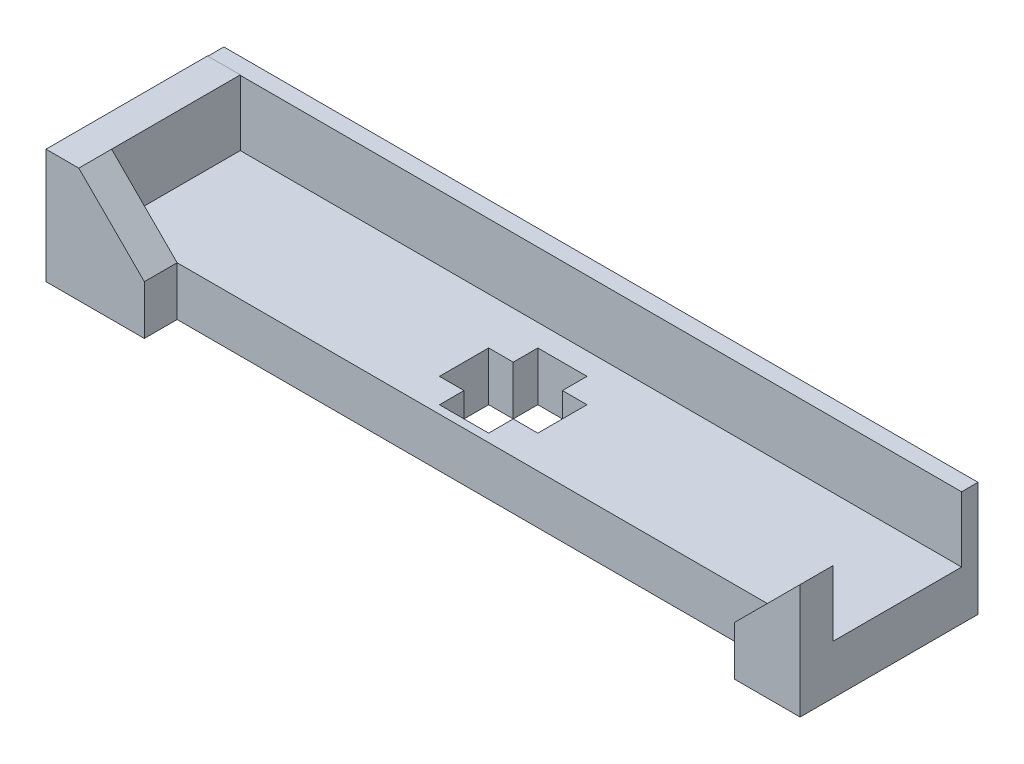
ISO-10303-21;
HEADER;
FILE_DESCRIPTION(('STEP AP214'),'2;1');
FILE_NAME('part.step','',(''),(''),'','','');
FILE_SCHEMA(('AUTOMOTIVE_DESIGN { 1 0 10303 214 1 1 1 1 }'));
ENDSEC;
DATA;
#1=APPLICATION_CONTEXT('core data for automotive mechanical design processes');
#2=APPLICATION_PROTOCOL_DEFINITION('international standard','automotive_design',2000,#1);
#3=PRODUCT_CONTEXT('',#1,'mechanical');
#4=PRODUCT('Part','Part','',(#3));
#5=PRODUCT_RELATED_PRODUCT_CATEGORY('part','',(#4));
#6=PRODUCT_DEFINITION_FORMATION('','',#4);
#7=PRODUCT_DEFINITION_CONTEXT('part definition',#1,'design');
#8=PRODUCT_DEFINITION('design','',#6,#7);
#9=PRODUCT_DEFINITION_SHAPE('','',#8);
#10=(LENGTH_UNIT() NAMED_UNIT(*) SI_UNIT(.MILLI.,.METRE.));
#11=(NAMED_UNIT(*) PLANE_ANGLE_UNIT() SI_UNIT($,.RADIAN.));
#12=(NAMED_UNIT(*) SI_UNIT($,.STERADIAN.) SOLID_ANGLE_UNIT());
#13=UNCERTAINTY_MEASURE_WITH_UNIT(LENGTH_MEASURE(1.E-05),#10,'distance_accuracy_value','');
#14=(GEOMETRIC_REPRESENTATION_CONTEXT(3) GLOBAL_UNCERTAINTY_ASSIGNED_CONTEXT((#13)) GLOBAL_UNIT_ASSIGNED_CONTEXT((#10,
#11,#12)) REPRESENTATION_CONTEXT('',''));
#15=CARTESIAN_POINT('',(0.,0.,0.));
#16=DIRECTION('',(0.,0.,1.));
#17=DIRECTION('',(1.,0.,0.));
#18=AXIS2_PLACEMENT_3D('',#15,#16,#17);
#19=CARTESIAN_POINT('',(-17.6129063467492,3.,12.4799729102168));
#20=DIRECTION('',(0.,0.,1.));
#21=DIRECTION('',(1.,0.,0.));
#22=AXIS2_PLACEMENT_3D('',#19,#20,#21);
#23=PLANE('',#22);
#24=DIRECTION('',(-1.,0.,0.));
#25=VECTOR('',#24,1.);
#26=CARTESIAN_POINT('',(-17.6129063467492,0.,12.4799729102168));
#27=LINE('',#26,#25);
#28=CARTESIAN_POINT('',(-11.6129063467492,0.,12.4799729102168));
#29=VERTEX_POINT('',#28);
#30=CARTESIAN_POINT('',(-13.1129063467492,0.,12.4799729102168));
#31=VERTEX_POINT('',#30);
#32=EDGE_CURVE('E262',#29,#31,#27,.T.);
#33=ORIENTED_EDGE('',*,*,#32,.T.);
#34=DIRECTION('',(0.,1.,0.));
#35=VECTOR('',#34,1.);
#36=CARTESIAN_POINT('',(-13.1129063467492,3.,12.4799729102168));
#37=LINE('',#36,#35);
#38=CARTESIAN_POINT('',(-13.1129063467492,3.,12.4799729102168));
#39=VERTEX_POINT('',#38);
#40=EDGE_CURVE('E254',#31,#39,#37,.T.);
#41=ORIENTED_EDGE('',*,*,#40,.T.);
#42=DIRECTION('',(-1.,0.,0.));
#43=VECTOR('',#42,1.);
#44=CARTESIAN_POINT('',(-17.6129063467492,3.,12.4799729102168));
#45=LINE('',#44,#43);
#46=CARTESIAN_POINT('',(-11.6129063467492,3.,12.4799729102168));
#47=VERTEX_POINT('',#46);
#48=EDGE_CURVE('E270',#47,#39,#45,.T.);
#49=ORIENTED_EDGE('',*,*,#48,.F.);
#50=DIRECTION('',(0.,-1.,0.));
#51=VECTOR('',#50,1.);
#52=CARTESIAN_POINT('',(-11.6129063467492,3.,12.4799729102168));
#53=LINE('',#52,#51);
#54=EDGE_CURVE('E288',#47,#29,#53,.T.);
#55=ORIENTED_EDGE('',*,*,#54,.T.);
#56=EDGE_LOOP('',(#33,#41,#49,#55));
#57=FACE_BOUND('',#56,.T.);
#58=ADVANCED_FACE('F35',(#57),#23,.F.);
#59=CARTESIAN_POINT('',(-17.6129063467492,3.,9.47997291021678));
#60=DIRECTION('',(0.,0.,-1.));
#61=DIRECTION('',(-1.,0.,0.));
#62=AXIS2_PLACEMENT_3D('',#59,#60,#61);
#63=PLANE('',#62);
#64=DIRECTION('',(1.,0.,0.));
#65=VECTOR('',#64,1.);
#66=CARTESIAN_POINT('',(-17.6129063467492,3.,9.47997291021678));
#67=LINE('',#66,#65);
#68=CARTESIAN_POINT('',(-13.1129063467492,3.,9.47997291021678));
#69=VERTEX_POINT('',#68);
#70=CARTESIAN_POINT('',(-11.6129063467492,3.,9.47997291021678));
#71=VERTEX_POINT('',#70);
#72=EDGE_CURVE('E261',#69,#71,#67,.T.);
#73=ORIENTED_EDGE('',*,*,#72,.F.);
#74=DIRECTION('',(0.,-1.,0.));
#75=VECTOR('',#74,1.);
#76=CARTESIAN_POINT('',(-13.1129063467492,3.,9.47997291021678));
#77=LINE('',#76,#75);
#78=CARTESIAN_POINT('',(-13.1129063467492,0.,9.47997291021678));
#79=VERTEX_POINT('',#78);
#80=EDGE_CURVE('E11',#69,#79,#77,.T.);
#81=ORIENTED_EDGE('',*,*,#80,.T.);
#82=DIRECTION('',(1.,0.,0.));
#83=VECTOR('',#82,1.);
#84=CARTESIAN_POINT('',(-17.6129063467492,0.,9.47997291021678));
#85=LINE('',#84,#83);
#86=CARTESIAN_POINT('',(-11.6129063467492,0.,9.47997291021678));
#87=VERTEX_POINT('',#86);
#88=EDGE_CURVE('E274',#79,#87,#85,.T.);
#89=ORIENTED_EDGE('',*,*,#88,.T.);
#90=DIRECTION('',(0.,-1.,0.));
#91=VECTOR('',#90,1.);
#92=CARTESIAN_POINT('',(-11.6129063467492,3.,9.47997291021678));
#93=LINE('',#92,#91);
#94=EDGE_CURVE('E290',#71,#87,#93,.T.);
#95=ORIENTED_EDGE('',*,*,#94,.F.);
#96=EDGE_LOOP('',(#73,#81,#89,#95));
#97=FACE_BOUND('',#96,.T.);
#98=ADVANCED_FACE('F488',(#97),#63,.F.);
#99=CARTESIAN_POINT('',(-35.6129063467492,3.,6.62997291021679));
#100=DIRECTION('',(0.,0.,1.));
#101=DIRECTION('',(1.,0.,0.));
#102=AXIS2_PLACEMENT_3D('',#99,#100,#101);
#103=PLANE('',#102);
#104=DIRECTION('',(1.,0.,0.));
#105=VECTOR('',#104,1.);
#106=CARTESIAN_POINT('',(8.38709365325076,6.97653999567155,6.62997291021679));
#107=LINE('',#106,#105);
#108=CARTESIAN_POINT('',(-37.6129063467492,6.97653999567155,6.62997291021678));
#109=VERTEX_POINT('',#108);
#110=CARTESIAN_POINT('',(-35.6129063467492,6.97653999567155,6.62997291021679));
#111=VERTEX_POINT('',#110);
#112=EDGE_CURVE('E299',#109,#111,#107,.T.);
#113=ORIENTED_EDGE('',*,*,#112,.F.);
#114=DIRECTION('',(0.,-1.,0.));
#115=VECTOR('',#114,1.);
#116=CARTESIAN_POINT('',(-37.6129063467492,0.,6.62997291021679));
#117=LINE('',#116,#115);
#118=CARTESIAN_POINT('',(-37.6129063467492,7.,6.62997291021678));
#119=VERTEX_POINT('',#118);
#120=EDGE_CURVE('E372',#119,#109,#117,.T.);
#121=ORIENTED_EDGE('',*,*,#120,.F.);
#122=DIRECTION('',(1.,0.,0.));
#123=VECTOR('',#122,1.);
#124=CARTESIAN_POINT('',(-37.6129063467492,7.,6.62997291021678));
#125=LINE('',#124,#123);
#126=CARTESIAN_POINT('',(-35.6129063467492,7.,6.62997291021678));
#127=VERTEX_POINT('',#126);
#128=EDGE_CURVE('E395',#119,#127,#125,.T.);
#129=ORIENTED_EDGE('',*,*,#128,.T.);
#130=DIRECTION('',(0.,-1.,0.));
#131=VECTOR('',#130,1.);
#132=CARTESIAN_POINT('',(-35.6129063467492,0.,6.62997291021679));
#133=LINE('',#132,#131);
#134=EDGE_CURVE('E383',#127,#111,#133,.T.);
#135=ORIENTED_EDGE('',*,*,#134,.T.);
#136=EDGE_LOOP('',(#113,#121,#129,#135));
#137=FACE_BOUND('',#136,.T.);
#138=ADVANCED_FACE('F514',(#137),#103,.F.);
#139=CARTESIAN_POINT('',(-35.6129063467492,3.,14.4799729102168));
#140=DIRECTION('',(0.,0.,-1.));
#141=DIRECTION('',(-1.,0.,0.));
#142=AXIS2_PLACEMENT_3D('',#139,#140,#141);
#143=PLANE('',#142);
#144=DIRECTION('',(0.,-1.,0.));
#145=VECTOR('',#144,1.);
#146=CARTESIAN_POINT('',(4.38709365325076,3.,14.4799729102168));
#147=LINE('',#146,#145);
#148=CARTESIAN_POINT('',(4.38709365325075,3.,14.4799729102168));
#149=VERTEX_POINT('',#148);
#150=CARTESIAN_POINT('',(4.38709365325075,0.,14.4799729102168));
#151=VERTEX_POINT('',#150);
#152=EDGE_CURVE('E319',#149,#151,#147,.T.);
#153=ORIENTED_EDGE('',*,*,#152,.F.);
#154=DIRECTION('',(1.,0.,0.));
#155=VECTOR('',#154,1.);
#156=CARTESIAN_POINT('',(-35.6129063467492,3.,14.4799729102168));
#157=LINE('',#156,#155);
#158=CARTESIAN_POINT('',(-31.6129063467492,3.,14.4799729102168));
#159=VERTEX_POINT('',#158);
#160=EDGE_CURVE('E407',#159,#149,#157,.T.);
#161=ORIENTED_EDGE('',*,*,#160,.F.);
#162=DIRECTION('',(0.,1.,0.));
#163=VECTOR('',#162,1.);
#164=CARTESIAN_POINT('',(-31.6129063467492,3.,14.4799729102168));
#165=LINE('',#164,#163);
#166=CARTESIAN_POINT('',(-31.6129063467492,0.,14.4799729102168));
#167=VERTEX_POINT('',#166);
#168=EDGE_CURVE('E344',#167,#159,#165,.T.);
#169=ORIENTED_EDGE('',*,*,#168,.F.);
#170=DIRECTION('',(1.,0.,0.));
#171=VECTOR('',#170,1.);
#172=CARTESIAN_POINT('',(-35.6129063467492,0.,14.4799729102168));
#173=LINE('',#172,#171);
#174=EDGE_CURVE('E417',#167,#151,#173,.T.);
#175=ORIENTED_EDGE('',*,*,#174,.T.);
#176=EDGE_LOOP('',(#153,#161,#169,#175));
#177=FACE_BOUND('',#176,.T.);
#178=ADVANCED_FACE('F37',(#177),#143,.F.);
#179=CARTESIAN_POINT('',(8.38709365325076,3.,6.62997291021679));
#180=DIRECTION('',(-1.,0.,0.));
#181=DIRECTION('',(0.,0.,1.));
#182=AXIS2_PLACEMENT_3D('',#179,#180,#181);
#183=PLANE('',#182);
#184=DIRECTION('',(0.,0.,-1.));
#185=VECTOR('',#184,1.);
#186=CARTESIAN_POINT('',(8.38709365325076,0.,6.62997291021679));
#187=LINE('',#186,#185);
#188=CARTESIAN_POINT('',(8.38709365325076,0.,16.4799729102168));
#189=VERTEX_POINT('',#188);
#190=CARTESIAN_POINT('',(8.38709365325076,0.,5.62997291021679));
#191=VERTEX_POINT('',#190);
#192=EDGE_CURVE('E408',#189,#191,#187,.T.);
#193=ORIENTED_EDGE('',*,*,#192,.T.);
#194=DIRECTION('',(0.,-1.,0.));
#195=VECTOR('',#194,1.);
#196=CARTESIAN_POINT('',(8.38709365325076,0.,5.62997291021679));
#197=LINE('',#196,#195);
#198=CARTESIAN_POINT('',(8.38709365325076,6.97653999567155,5.62997291021679));
#199=VERTEX_POINT('',#198);
#200=EDGE_CURVE('E295',#199,#191,#197,.T.);
#201=ORIENTED_EDGE('',*,*,#200,.F.);
#202=DIRECTION('',(0.,0.,1.));
#203=VECTOR('',#202,1.);
#204=CARTESIAN_POINT('',(8.38709365325076,6.97653999567155,5.62997291021679));
#205=LINE('',#204,#203);
#206=CARTESIAN_POINT('',(8.38709365325076,6.97653999567155,6.62997291021679));
#207=VERTEX_POINT('',#206);
#208=EDGE_CURVE('E306',#199,#207,#205,.T.);
#209=ORIENTED_EDGE('',*,*,#208,.T.);
#210=DIRECTION('',(0.,-1.,0.));
#211=VECTOR('',#210,1.);
#212=CARTESIAN_POINT('',(8.38709365325076,0.,6.62997291021679));
#213=LINE('',#212,#211);
#214=CARTESIAN_POINT('',(8.38709365325076,3.,6.62997291021679));
#215=VERTEX_POINT('',#214);
#216=EDGE_CURVE('E287',#207,#215,#213,.T.);
#217=ORIENTED_EDGE('',*,*,#216,.T.);
#218=DIRECTION('',(0.,0.,-1.));
#219=VECTOR('',#218,1.);
#220=CARTESIAN_POINT('',(8.38709365325076,3.,6.62997291021679));
#221=LINE('',#220,#219);
#222=CARTESIAN_POINT('',(8.38709365325076,3.,14.4799729102168));
#223=VERTEX_POINT('',#222);
#224=EDGE_CURVE('E414',#223,#215,#221,.T.);
#225=ORIENTED_EDGE('',*,*,#224,.F.);
#226=DIRECTION('',(0.,1.,0.));
#227=VECTOR('',#226,1.);
#228=CARTESIAN_POINT('',(8.38709365325076,0.,14.4799729102168));
#229=LINE('',#228,#227);
#230=CARTESIAN_POINT('',(8.38709365325076,7.,14.4799729102168));
#231=VERTEX_POINT('',#230);
#232=EDGE_CURVE('E326',#223,#231,#229,.T.);
#233=ORIENTED_EDGE('',*,*,#232,.T.);
#234=DIRECTION('',(0.,0.,-1.));
#235=VECTOR('',#234,1.);
#236=CARTESIAN_POINT('',(8.38709365325076,7.,16.4799729102168));
#237=LINE('',#236,#235);
#238=CARTESIAN_POINT('',(8.38709365325076,7.,16.4799729102168));
#239=VERTEX_POINT('',#238);
#240=EDGE_CURVE('E339',#239,#231,#237,.T.);
#241=ORIENTED_EDGE('',*,*,#240,.F.);
#242=DIRECTION('',(0.,1.,0.));
#243=VECTOR('',#242,1.);
#244=CARTESIAN_POINT('',(8.38709365325076,0.,16.4799729102168));
#245=LINE('',#244,#243);
#246=EDGE_CURVE('E318',#189,#239,#245,.T.);
#247=ORIENTED_EDGE('',*,*,#246,.F.);
#248=EDGE_LOOP('',(#193,#201,#209,#217,#225,#233,#241,#247));
#249=FACE_BOUND('',#248,.T.);
#250=ADVANCED_FACE('F455',(#249),#183,.F.);
#251=CARTESIAN_POINT('',(0.,3.,0.));
#252=DIRECTION('',(0.,1.,0.));
#253=DIRECTION('',(0.,0.,1.));
#254=AXIS2_PLACEMENT_3D('',#251,#252,#253);
#255=PLANE('',#254);
#256=DIRECTION('',(0.,0.,1.));
#257=VECTOR('',#256,1.);
#258=CARTESIAN_POINT('',(-13.1129063467492,3.,13.9799729102168));
#259=LINE('',#258,#257);
#260=CARTESIAN_POINT('',(-13.1129063467492,3.,7.97997291021679));
#261=VERTEX_POINT('',#260);
#262=EDGE_CURVE('E218',#261,#69,#259,.T.);
#263=ORIENTED_EDGE('',*,*,#262,.T.);
#264=ORIENTED_EDGE('',*,*,#72,.T.);
#265=DIRECTION('',(0.,0.,1.));
#266=VECTOR('',#265,1.);
#267=CARTESIAN_POINT('',(-11.6129063467492,3.,12.4799729102168));
#268=LINE('',#267,#266);
#269=EDGE_CURVE('E266',#71,#47,#268,.T.);
#270=ORIENTED_EDGE('',*,*,#269,.T.);
#271=ORIENTED_EDGE('',*,*,#48,.T.);
#272=CARTESIAN_POINT('',(-13.1129063467492,3.,13.9799729102168));
#273=VERTEX_POINT('',#272);
#274=EDGE_CURVE('E232',#39,#273,#259,.T.);
#275=ORIENTED_EDGE('',*,*,#274,.T.);
#276=DIRECTION('',(-1.,0.,0.));
#277=VECTOR('',#276,1.);
#278=CARTESIAN_POINT('',(-16.1129063467492,3.,13.9799729102168));
#279=LINE('',#278,#277);
#280=CARTESIAN_POINT('',(-16.1129063467492,3.,13.9799729102168));
#281=VERTEX_POINT('',#280);
#282=EDGE_CURVE('E213',#273,#281,#279,.T.);
#283=ORIENTED_EDGE('',*,*,#282,.T.);
#284=DIRECTION('',(0.,0.,-1.));
#285=VECTOR('',#284,1.);
#286=CARTESIAN_POINT('',(-16.1129063467492,3.,13.9799729102168));
#287=LINE('',#286,#285);
#288=CARTESIAN_POINT('',(-16.1129063467492,3.,12.4799729102168));
#289=VERTEX_POINT('',#288);
#290=EDGE_CURVE('E221',#281,#289,#287,.T.);
#291=ORIENTED_EDGE('',*,*,#290,.T.);
#292=CARTESIAN_POINT('',(-17.6129063467492,3.,12.4799729102168));
#293=VERTEX_POINT('',#292);
#294=EDGE_CURVE('E269',#289,#293,#45,.T.);
#295=ORIENTED_EDGE('',*,*,#294,.T.);
#296=DIRECTION('',(0.,0.,-1.));
#297=VECTOR('',#296,1.);
#298=CARTESIAN_POINT('',(-17.6129063467492,3.,12.4799729102168));
#299=LINE('',#298,#297);
#300=CARTESIAN_POINT('',(-17.6129063467492,3.,9.47997291021678));
#301=VERTEX_POINT('',#300);
#302=EDGE_CURVE('E258',#293,#301,#299,.T.);
#303=ORIENTED_EDGE('',*,*,#302,.T.);
#304=CARTESIAN_POINT('',(-16.1129063467492,3.,9.47997291021678));
#305=VERTEX_POINT('',#304);
#306=EDGE_CURVE('E263',#301,#305,#67,.T.);
#307=ORIENTED_EDGE('',*,*,#306,.T.);
#308=CARTESIAN_POINT('',(-16.1129063467492,3.,7.97997291021678));
#309=VERTEX_POINT('',#308);
#310=EDGE_CURVE('E58',#305,#309,#287,.T.);
#311=ORIENTED_EDGE('',*,*,#310,.T.);
#312=DIRECTION('',(1.,0.,0.));
#313=VECTOR('',#312,1.);
#314=CARTESIAN_POINT('',(-16.1129063467492,3.,7.97997291021678));
#315=LINE('',#314,#313);
#316=EDGE_CURVE('E226',#309,#261,#315,.T.);
#317=ORIENTED_EDGE('',*,*,#316,.T.);
#318=EDGE_LOOP('',(#263,#264,#270,#271,#275,#283,#291,#295,#303,#307,#311,#317));
#319=FACE_BOUND('',#318,.T.);
#320=DIRECTION('',(0.,0.,1.));
#321=VECTOR('',#320,1.);
#322=CARTESIAN_POINT('',(-35.6129063467492,3.,6.62997291021679));
#323=LINE('',#322,#321);
#324=CARTESIAN_POINT('',(-35.6129063467492,3.,6.62997291021679));
#325=VERTEX_POINT('',#324);
#326=CARTESIAN_POINT('',(-35.6129063467492,3.,14.4799729102168));
#327=VERTEX_POINT('',#326);
#328=EDGE_CURVE('E403',#325,#327,#323,.T.);
#329=ORIENTED_EDGE('',*,*,#328,.T.);
#330=EDGE_CURVE('E421',#327,#159,#157,.T.);
#331=ORIENTED_EDGE('',*,*,#330,.T.);
#332=ORIENTED_EDGE('',*,*,#160,.T.);
#333=DIRECTION('',(1.,0.,0.));
#334=VECTOR('',#333,1.);
#335=CARTESIAN_POINT('',(0.,3.,14.4799729102168));
#336=LINE('',#335,#334);
#337=EDGE_CURVE('E342',#149,#223,#336,.T.);
#338=ORIENTED_EDGE('',*,*,#337,.T.);
#339=ORIENTED_EDGE('',*,*,#224,.T.);
#340=DIRECTION('',(-1.,0.,0.));
#341=VECTOR('',#340,1.);
#342=CARTESIAN_POINT('',(-35.6129063467492,3.,6.62997291021679));
#343=LINE('',#342,#341);
#344=EDGE_CURVE('E411',#215,#325,#343,.T.);
#345=ORIENTED_EDGE('',*,*,#344,.T.);
#346=EDGE_LOOP('',(#329,#331,#332,#338,#339,#345));
#347=FACE_BOUND('',#346,.T.);
#348=ADVANCED_FACE('F229',(#319,#347),#255,.T.);
#349=CARTESIAN_POINT('',(0.,0.,0.));
#350=DIRECTION('',(0.,1.,0.));
#351=DIRECTION('',(0.,0.,1.));
#352=AXIS2_PLACEMENT_3D('',#349,#350,#351);
#353=PLANE('',#352);
#354=ORIENTED_EDGE('',*,*,#88,.F.);
#355=DIRECTION('',(0.,0.,1.));
#356=VECTOR('',#355,1.);
#357=CARTESIAN_POINT('',(-13.1129063467492,0.,13.9799729102168));
#358=LINE('',#357,#356);
#359=CARTESIAN_POINT('',(-13.1129063467492,0.,7.97997291021679));
#360=VERTEX_POINT('',#359);
#361=EDGE_CURVE('E233',#360,#79,#358,.T.);
#362=ORIENTED_EDGE('',*,*,#361,.F.);
#363=DIRECTION('',(1.,0.,0.));
#364=VECTOR('',#363,1.);
#365=CARTESIAN_POINT('',(-16.1129063467492,0.,7.97997291021678));
#366=LINE('',#365,#364);
#367=CARTESIAN_POINT('',(-16.1129063467492,0.,7.97997291021678));
#368=VERTEX_POINT('',#367);
#369=EDGE_CURVE('E244',#368,#360,#366,.T.);
#370=ORIENTED_EDGE('',*,*,#369,.F.);
#371=DIRECTION('',(0.,0.,-1.));
#372=VECTOR('',#371,1.);
#373=CARTESIAN_POINT('',(-16.1129063467492,0.,13.9799729102168));
#374=LINE('',#373,#372);
#375=CARTESIAN_POINT('',(-16.1129063467492,0.,9.47997291021678));
#376=VERTEX_POINT('',#375);
#377=EDGE_CURVE('E242',#376,#368,#374,.T.);
#378=ORIENTED_EDGE('',*,*,#377,.F.);
#379=CARTESIAN_POINT('',(-17.6129063467492,0.,9.47997291021678));
#380=VERTEX_POINT('',#379);
#381=EDGE_CURVE('E275',#380,#376,#85,.T.);
#382=ORIENTED_EDGE('',*,*,#381,.F.);
#383=DIRECTION('',(0.,0.,-1.));
#384=VECTOR('',#383,1.);
#385=CARTESIAN_POINT('',(-17.6129063467492,0.,12.4799729102168));
#386=LINE('',#385,#384);
#387=CARTESIAN_POINT('',(-17.6129063467492,0.,12.4799729102168));
#388=VERTEX_POINT('',#387);
#389=EDGE_CURVE('E257',#388,#380,#386,.T.);
#390=ORIENTED_EDGE('',*,*,#389,.F.);
#391=CARTESIAN_POINT('',(-16.1129063467492,0.,12.4799729102168));
#392=VERTEX_POINT('',#391);
#393=EDGE_CURVE('E281',#392,#388,#27,.T.);
#394=ORIENTED_EDGE('',*,*,#393,.F.);
#395=CARTESIAN_POINT('',(-16.1129063467492,0.,13.9799729102168));
#396=VERTEX_POINT('',#395);
#397=EDGE_CURVE('E50',#396,#392,#374,.T.);
#398=ORIENTED_EDGE('',*,*,#397,.F.);
#399=DIRECTION('',(-1.,0.,0.));
#400=VECTOR('',#399,1.);
#401=CARTESIAN_POINT('',(-16.1129063467492,0.,13.9799729102168));
#402=LINE('',#401,#400);
#403=CARTESIAN_POINT('',(-13.1129063467492,0.,13.9799729102168));
#404=VERTEX_POINT('',#403);
#405=EDGE_CURVE('E216',#404,#396,#402,.T.);
#406=ORIENTED_EDGE('',*,*,#405,.F.);
#407=EDGE_CURVE('E235',#31,#404,#358,.T.);
#408=ORIENTED_EDGE('',*,*,#407,.F.);
#409=ORIENTED_EDGE('',*,*,#32,.F.);
#410=DIRECTION('',(0.,0.,1.));
#411=VECTOR('',#410,1.);
#412=CARTESIAN_POINT('',(-11.6129063467492,0.,12.4799729102168));
#413=LINE('',#412,#411);
#414=EDGE_CURVE('E278',#87,#29,#413,.T.);
#415=ORIENTED_EDGE('',*,*,#414,.F.);
#416=EDGE_LOOP('',(#354,#362,#370,#378,#382,#390,#394,#398,#406,#408,#409,#415));
#417=FACE_BOUND('',#416,.T.);
#418=ORIENTED_EDGE('',*,*,#174,.F.);
#419=DIRECTION('',(0.,0.,-1.));
#420=VECTOR('',#419,1.);
#421=CARTESIAN_POINT('',(-31.6129063467492,0.,16.4799729102168));
#422=LINE('',#421,#420);
#423=CARTESIAN_POINT('',(-31.6129063467492,0.,16.4799729102168));
#424=VERTEX_POINT('',#423);
#425=EDGE_CURVE('E366',#424,#167,#422,.T.);
#426=ORIENTED_EDGE('',*,*,#425,.F.);
#427=DIRECTION('',(1.,0.,0.));
#428=VECTOR('',#427,1.);
#429=CARTESIAN_POINT('',(-35.6129063467492,0.,16.4799729102168));
#430=LINE('',#429,#428);
#431=CARTESIAN_POINT('',(-37.6129063467492,0.,16.4799729102168));
#432=VERTEX_POINT('',#431);
#433=EDGE_CURVE('E352',#432,#424,#430,.T.);
#434=ORIENTED_EDGE('',*,*,#433,.F.);
#435=DIRECTION('',(0.,0.,1.));
#436=VECTOR('',#435,1.);
#437=CARTESIAN_POINT('',(-37.6129063467492,0.,6.62997291021679));
#438=LINE('',#437,#436);
#439=CARTESIAN_POINT('',(-37.6129063467492,0.,5.62997291021679));
#440=VERTEX_POINT('',#439);
#441=EDGE_CURVE('E369',#440,#432,#438,.T.);
#442=ORIENTED_EDGE('',*,*,#441,.F.);
#443=DIRECTION('',(-1.,0.,0.));
#444=VECTOR('',#443,1.);
#445=CARTESIAN_POINT('',(8.38709365325076,0.,5.62997291021679));
#446=LINE('',#445,#444);
#447=EDGE_CURVE('E298',#191,#440,#446,.T.);
#448=ORIENTED_EDGE('',*,*,#447,.F.);
#449=ORIENTED_EDGE('',*,*,#192,.F.);
#450=DIRECTION('',(1.,0.,0.));
#451=VECTOR('',#450,1.);
#452=CARTESIAN_POINT('',(4.38709365325075,0.,16.4799729102168));
#453=LINE('',#452,#451);
#454=CARTESIAN_POINT('',(4.38709365325075,0.,16.4799729102168));
#455=VERTEX_POINT('',#454);
#456=EDGE_CURVE('E315',#455,#189,#453,.T.);
#457=ORIENTED_EDGE('',*,*,#456,.F.);
#458=DIRECTION('',(0.,0.,-1.));
#459=VECTOR('',#458,1.);
#460=CARTESIAN_POINT('',(4.38709365325075,0.,16.4799729102168));
#461=LINE('',#460,#459);
#462=EDGE_CURVE('E325',#455,#151,#461,.T.);
#463=ORIENTED_EDGE('',*,*,#462,.T.);
#464=EDGE_LOOP('',(#418,#426,#434,#442,#448,#449,#457,#463));
#465=FACE_BOUND('',#464,.T.);
#466=ADVANCED_FACE('F434',(#417,#465),#353,.F.);
#467=CARTESIAN_POINT('',(-35.6129063467492,0.,0.));
#468=DIRECTION('',(1.,0.,0.));
#469=DIRECTION('',(0.,0.,-1.));
#470=AXIS2_PLACEMENT_3D('',#467,#468,#469);
#471=PLANE('',#470);
#472=ORIENTED_EDGE('',*,*,#328,.F.);
#473=EDGE_CURVE('E379',#111,#325,#133,.T.);
#474=ORIENTED_EDGE('',*,*,#473,.F.);
#475=ORIENTED_EDGE('',*,*,#134,.F.);
#476=DIRECTION('',(0.,0.,-1.));
#477=VECTOR('',#476,1.);
#478=CARTESIAN_POINT('',(-35.6129063467492,7.,6.62997291021678));
#479=LINE('',#478,#477);
#480=CARTESIAN_POINT('',(-35.6129063467492,7.,14.4799729102168));
#481=VERTEX_POINT('',#480);
#482=EDGE_CURVE('E376',#481,#127,#479,.T.);
#483=ORIENTED_EDGE('',*,*,#482,.F.);
#484=DIRECTION('',(0.,1.,0.));
#485=VECTOR('',#484,1.);
#486=CARTESIAN_POINT('',(-35.6129063467492,0.,14.4799729102168));
#487=LINE('',#486,#485);
#488=EDGE_CURVE('E394',#327,#481,#487,.T.);
#489=ORIENTED_EDGE('',*,*,#488,.F.);
#490=EDGE_LOOP('',(#472,#474,#475,#483,#489));
#491=FACE_BOUND('',#490,.T.);
#492=ADVANCED_FACE('F585',(#491),#471,.T.);
#493=CARTESIAN_POINT('',(-37.6129063467492,7.,6.62997291021678));
#494=DIRECTION('',(0.,-1.,0.));
#495=DIRECTION('',(0.,0.,-1.));
#496=AXIS2_PLACEMENT_3D('',#493,#494,#495);
#497=PLANE('',#496);
#498=ORIENTED_EDGE('',*,*,#482,.T.);
#499=ORIENTED_EDGE('',*,*,#128,.F.);
#500=DIRECTION('',(0.,0.,-1.));
#501=VECTOR('',#500,1.);
#502=CARTESIAN_POINT('',(-37.6129063467492,7.,6.62997291021678));
#503=LINE('',#502,#501);
#504=CARTESIAN_POINT('',(-37.6129063467492,7.,16.4799729102168));
#505=VERTEX_POINT('',#504);
#506=EDGE_CURVE('E387',#505,#119,#503,.T.);
#507=ORIENTED_EDGE('',*,*,#506,.F.);
#508=DIRECTION('',(-1.,0.,0.));
#509=VECTOR('',#508,1.);
#510=CARTESIAN_POINT('',(-37.6129063467492,7.,16.4799729102168));
#511=LINE('',#510,#509);
#512=CARTESIAN_POINT('',(-35.6129063467492,7.,16.4799729102168));
#513=VERTEX_POINT('',#512);
#514=EDGE_CURVE('E345',#513,#505,#511,.T.);
#515=ORIENTED_EDGE('',*,*,#514,.F.);
#516=DIRECTION('',(0.,0.,-1.));
#517=VECTOR('',#516,1.);
#518=CARTESIAN_POINT('',(-35.6129063467492,7.,16.4799729102168));
#519=LINE('',#518,#517);
#520=EDGE_CURVE('E358',#513,#481,#519,.T.);
#521=ORIENTED_EDGE('',*,*,#520,.T.);
#522=EDGE_LOOP('',(#498,#499,#507,#515,#521));
#523=FACE_BOUND('',#522,.T.);
#524=ADVANCED_FACE('F656',(#523),#497,.F.);
#525=CARTESIAN_POINT('',(-37.6129063467492,0.,0.));
#526=DIRECTION('',(1.,0.,0.));
#527=DIRECTION('',(0.,0.,-1.));
#528=AXIS2_PLACEMENT_3D('',#525,#526,#527);
#529=PLANE('',#528);
#530=ORIENTED_EDGE('',*,*,#120,.T.);
#531=DIRECTION('',(0.,0.,1.));
#532=VECTOR('',#531,1.);
#533=CARTESIAN_POINT('',(-37.6129063467492,6.97653999567155,5.62997291021679));
#534=LINE('',#533,#532);
#535=CARTESIAN_POINT('',(-37.6129063467492,6.97653999567155,5.62997291021679));
#536=VERTEX_POINT('',#535);
#537=EDGE_CURVE('E329',#536,#109,#534,.T.);
#538=ORIENTED_EDGE('',*,*,#537,.F.);
#539=DIRECTION('',(0.,1.,0.));
#540=VECTOR('',#539,1.);
#541=CARTESIAN_POINT('',(-37.6129063467492,0.,5.62997291021679));
#542=LINE('',#541,#540);
#543=EDGE_CURVE('E302',#440,#536,#542,.T.);
#544=ORIENTED_EDGE('',*,*,#543,.F.);
#545=ORIENTED_EDGE('',*,*,#441,.T.);
#546=DIRECTION('',(0.,-1.,0.));
#547=VECTOR('',#546,1.);
#548=CARTESIAN_POINT('',(-37.6129063467492,0.,16.4799729102168));
#549=LINE('',#548,#547);
#550=EDGE_CURVE('E348',#505,#432,#549,.T.);
#551=ORIENTED_EDGE('',*,*,#550,.F.);
#552=ORIENTED_EDGE('',*,*,#506,.T.);
#553=EDGE_LOOP('',(#530,#538,#544,#545,#551,#552));
#554=FACE_BOUND('',#553,.T.);
#555=ADVANCED_FACE('F651',(#554),#529,.F.);
#556=CARTESIAN_POINT('',(0.,0.,14.4799729102168));
#557=DIRECTION('',(0.,0.,-1.));
#558=DIRECTION('',(-1.,0.,0.));
#559=AXIS2_PLACEMENT_3D('',#556,#557,#558);
#560=PLANE('',#559);
#561=ORIENTED_EDGE('',*,*,#330,.F.);
#562=ORIENTED_EDGE('',*,*,#488,.T.);
#563=DIRECTION('',(-0.707106781186548,0.707106781186547,0.));
#564=VECTOR('',#563,1.);
#565=CARTESIAN_POINT('',(-35.6129063467492,7.,14.4799729102168));
#566=LINE('',#565,#564);
#567=EDGE_CURVE('E349',#159,#481,#566,.T.);
#568=ORIENTED_EDGE('',*,*,#567,.F.);
#569=EDGE_LOOP('',(#561,#562,#568));
#570=FACE_BOUND('',#569,.T.);
#571=ADVANCED_FACE('F655',(#570),#560,.T.);
#572=CARTESIAN_POINT('',(-31.6129063467492,3.,16.4799729102168));
#573=DIRECTION('',(-1.,0.,0.));
#574=DIRECTION('',(0.,0.,1.));
#575=AXIS2_PLACEMENT_3D('',#572,#573,#574);
#576=PLANE('',#575);
#577=ORIENTED_EDGE('',*,*,#168,.T.);
#578=DIRECTION('',(0.,0.,-1.));
#579=VECTOR('',#578,1.);
#580=CARTESIAN_POINT('',(-31.6129063467492,3.,16.4799729102168));
#581=LINE('',#580,#579);
#582=CARTESIAN_POINT('',(-31.6129063467492,3.,16.4799729102168));
#583=VERTEX_POINT('',#582);
#584=EDGE_CURVE('E363',#583,#159,#581,.T.);
#585=ORIENTED_EDGE('',*,*,#584,.F.);
#586=DIRECTION('',(0.,1.,0.));
#587=VECTOR('',#586,1.);
#588=CARTESIAN_POINT('',(-31.6129063467492,3.,16.4799729102168));
#589=LINE('',#588,#587);
#590=EDGE_CURVE('E354',#424,#583,#589,.T.);
#591=ORIENTED_EDGE('',*,*,#590,.F.);
#592=ORIENTED_EDGE('',*,*,#425,.T.);
#593=EDGE_LOOP('',(#577,#585,#591,#592));
#594=FACE_BOUND('',#593,.T.);
#595=ADVANCED_FACE('F429',(#594),#576,.F.);
#596=CARTESIAN_POINT('',(-35.6129063467492,7.,16.4799729102168));
#597=DIRECTION('',(-0.707106781186547,-0.707106781186548,0.));
#598=DIRECTION('',(0.707106781186548,-0.707106781186547,0.));
#599=AXIS2_PLACEMENT_3D('',#596,#597,#598);
#600=PLANE('',#599);
#601=ORIENTED_EDGE('',*,*,#567,.T.);
#602=ORIENTED_EDGE('',*,*,#520,.F.);
#603=DIRECTION('',(-0.707106781186548,0.707106781186547,0.));
#604=VECTOR('',#603,1.);
#605=CARTESIAN_POINT('',(-35.6129063467492,7.,16.4799729102168));
#606=LINE('',#605,#604);
#607=EDGE_CURVE('E356',#583,#513,#606,.T.);
#608=ORIENTED_EDGE('',*,*,#607,.F.);
#609=ORIENTED_EDGE('',*,*,#584,.T.);
#610=EDGE_LOOP('',(#601,#602,#608,#609));
#611=FACE_BOUND('',#610,.T.);
#612=ADVANCED_FACE('F734',(#611),#600,.F.);
#613=CARTESIAN_POINT('',(0.,0.,16.4799729102168));
#614=DIRECTION('',(0.,0.,-1.));
#615=DIRECTION('',(-1.,0.,0.));
#616=AXIS2_PLACEMENT_3D('',#613,#614,#615);
#617=PLANE('',#616);
#618=ORIENTED_EDGE('',*,*,#514,.T.);
#619=ORIENTED_EDGE('',*,*,#550,.T.);
#620=ORIENTED_EDGE('',*,*,#433,.T.);
#621=ORIENTED_EDGE('',*,*,#590,.T.);
#622=ORIENTED_EDGE('',*,*,#607,.T.);
#623=EDGE_LOOP('',(#618,#619,#620,#621,#622));
#624=FACE_BOUND('',#623,.T.);
#625=ADVANCED_FACE('F718',(#624),#617,.F.);
#626=CARTESIAN_POINT('',(8.38709365325076,7.,16.4799729102168));
#627=DIRECTION('',(0.707106781186547,-0.707106781186547,0.));
#628=DIRECTION('',(0.707106781186548,0.707106781186548,0.));
#629=AXIS2_PLACEMENT_3D('',#626,#627,#628);
#630=PLANE('',#629);
#631=DIRECTION('',(-0.707106781186548,-0.707106781186548,0.));
#632=VECTOR('',#631,1.);
#633=CARTESIAN_POINT('',(8.38709365325076,7.,14.4799729102168));
#634=LINE('',#633,#632);
#635=EDGE_CURVE('E328',#231,#149,#634,.T.);
#636=ORIENTED_EDGE('',*,*,#635,.T.);
#637=DIRECTION('',(0.,0.,-1.));
#638=VECTOR('',#637,1.);
#639=CARTESIAN_POINT('',(4.38709365325076,3.,16.4799729102168));
#640=LINE('',#639,#638);
#641=CARTESIAN_POINT('',(4.38709365325076,3.,16.4799729102168));
#642=VERTEX_POINT('',#641);
#643=EDGE_CURVE('E336',#642,#149,#640,.T.);
#644=ORIENTED_EDGE('',*,*,#643,.F.);
#645=DIRECTION('',(-0.707106781186548,-0.707106781186548,0.));
#646=VECTOR('',#645,1.);
#647=CARTESIAN_POINT('',(8.38709365325076,7.,16.4799729102168));
#648=LINE('',#647,#646);
#649=EDGE_CURVE('E321',#239,#642,#648,.T.);
#650=ORIENTED_EDGE('',*,*,#649,.F.);
#651=ORIENTED_EDGE('',*,*,#240,.T.);
#652=EDGE_LOOP('',(#636,#644,#650,#651));
#653=FACE_BOUND('',#652,.T.);
#654=ADVANCED_FACE('F445',(#653),#630,.F.);
#655=CARTESIAN_POINT('',(4.38709365325076,3.,16.4799729102168));
#656=DIRECTION('',(1.,0.,0.));
#657=DIRECTION('',(0.,1.,0.));
#658=AXIS2_PLACEMENT_3D('',#655,#656,#657);
#659=PLANE('',#658);
#660=ORIENTED_EDGE('',*,*,#152,.T.);
#661=ORIENTED_EDGE('',*,*,#462,.F.);
#662=DIRECTION('',(0.,-1.,0.));
#663=VECTOR('',#662,1.);
#664=CARTESIAN_POINT('',(4.38709365325076,3.,16.4799729102168));
#665=LINE('',#664,#663);
#666=EDGE_CURVE('E323',#642,#455,#665,.T.);
#667=ORIENTED_EDGE('',*,*,#666,.F.);
#668=ORIENTED_EDGE('',*,*,#643,.T.);
#669=EDGE_LOOP('',(#660,#661,#667,#668));
#670=FACE_BOUND('',#669,.T.);
#671=ADVANCED_FACE('F440',(#670),#659,.F.);
#672=CARTESIAN_POINT('',(0.,0.,16.4799729102168));
#673=DIRECTION('',(0.,0.,1.));
#674=DIRECTION('',(1.,0.,0.));
#675=AXIS2_PLACEMENT_3D('',#672,#673,#674);
#676=PLANE('',#675);
#677=ORIENTED_EDGE('',*,*,#456,.T.);
#678=ORIENTED_EDGE('',*,*,#246,.T.);
#679=ORIENTED_EDGE('',*,*,#649,.T.);
#680=ORIENTED_EDGE('',*,*,#666,.T.);
#681=EDGE_LOOP('',(#677,#678,#679,#680));
#682=FACE_BOUND('',#681,.T.);
#683=ADVANCED_FACE('F692',(#682),#676,.T.);
#684=CARTESIAN_POINT('',(0.,0.,14.4799729102168));
#685=DIRECTION('',(0.,0.,1.));
#686=DIRECTION('',(1.,0.,0.));
#687=AXIS2_PLACEMENT_3D('',#684,#685,#686);
#688=PLANE('',#687);
#689=ORIENTED_EDGE('',*,*,#337,.F.);
#690=ORIENTED_EDGE('',*,*,#635,.F.);
#691=ORIENTED_EDGE('',*,*,#232,.F.);
#692=EDGE_LOOP('',(#689,#690,#691));
#693=FACE_BOUND('',#692,.T.);
#694=ADVANCED_FACE('F451',(#693),#688,.F.);
#695=CARTESIAN_POINT('',(8.38709365325076,6.97653999567155,5.62997291021679));
#696=DIRECTION('',(0.,-1.,0.));
#697=DIRECTION('',(0.,0.,-1.));
#698=AXIS2_PLACEMENT_3D('',#695,#696,#697);
#699=PLANE('',#698);
#700=ORIENTED_EDGE('',*,*,#112,.T.);
#701=EDGE_CURVE('E309',#111,#207,#107,.T.);
#702=ORIENTED_EDGE('',*,*,#701,.T.);
#703=ORIENTED_EDGE('',*,*,#208,.F.);
#704=DIRECTION('',(1.,0.,0.));
#705=VECTOR('',#704,1.);
#706=CARTESIAN_POINT('',(8.38709365325076,6.97653999567155,5.62997291021679));
#707=LINE('',#706,#705);
#708=EDGE_CURVE('E304',#536,#199,#707,.T.);
#709=ORIENTED_EDGE('',*,*,#708,.F.);
#710=ORIENTED_EDGE('',*,*,#537,.T.);
#711=EDGE_LOOP('',(#700,#702,#703,#709,#710));
#712=FACE_BOUND('',#711,.T.);
#713=ADVANCED_FACE('F635',(#712),#699,.F.);
#714=CARTESIAN_POINT('',(0.,0.,5.62997291021679));
#715=DIRECTION('',(0.,0.,1.));
#716=DIRECTION('',(1.,0.,0.));
#717=AXIS2_PLACEMENT_3D('',#714,#715,#716);
#718=PLANE('',#717);
#719=ORIENTED_EDGE('',*,*,#200,.T.);
#720=ORIENTED_EDGE('',*,*,#447,.T.);
#721=ORIENTED_EDGE('',*,*,#543,.T.);
#722=ORIENTED_EDGE('',*,*,#708,.T.);
#723=EDGE_LOOP('',(#719,#720,#721,#722));
#724=FACE_BOUND('',#723,.T.);
#725=ADVANCED_FACE('F625',(#724),#718,.F.);
#726=CARTESIAN_POINT('',(0.,0.,6.62997291021679));
#727=DIRECTION('',(0.,0.,1.));
#728=DIRECTION('',(1.,0.,0.));
#729=AXIS2_PLACEMENT_3D('',#726,#727,#728);
#730=PLANE('',#729);
#731=ORIENTED_EDGE('',*,*,#701,.F.);
#732=ORIENTED_EDGE('',*,*,#473,.T.);
#733=ORIENTED_EDGE('',*,*,#344,.F.);
#734=ORIENTED_EDGE('',*,*,#216,.F.);
#735=EDGE_LOOP('',(#731,#732,#733,#734));
#736=FACE_BOUND('',#735,.T.);
#737=ADVANCED_FACE('F507',(#736),#730,.T.);
#738=CARTESIAN_POINT('',(-17.6129063467492,3.,12.4799729102168));
#739=DIRECTION('',(-1.,0.,0.));
#740=DIRECTION('',(0.,0.,1.));
#741=AXIS2_PLACEMENT_3D('',#738,#739,#740);
#742=PLANE('',#741);
#743=ORIENTED_EDGE('',*,*,#389,.T.);
#744=DIRECTION('',(0.,-1.,0.));
#745=VECTOR('',#744,1.);
#746=CARTESIAN_POINT('',(-17.6129063467492,3.,9.47997291021678));
#747=LINE('',#746,#745);
#748=EDGE_CURVE('E272',#301,#380,#747,.T.);
#749=ORIENTED_EDGE('',*,*,#748,.F.);
#750=ORIENTED_EDGE('',*,*,#302,.F.);
#751=DIRECTION('',(0.,-1.,0.));
#752=VECTOR('',#751,1.);
#753=CARTESIAN_POINT('',(-17.6129063467492,3.,12.4799729102168));
#754=LINE('',#753,#752);
#755=EDGE_CURVE('E284',#293,#388,#754,.T.);
#756=ORIENTED_EDGE('',*,*,#755,.T.);
#757=EDGE_LOOP('',(#743,#749,#750,#756));
#758=FACE_BOUND('',#757,.T.);
#759=ADVANCED_FACE('F471',(#758),#742,.F.);
#760=ORIENTED_EDGE('',*,*,#294,.F.);
#761=DIRECTION('',(0.,-1.,0.));
#762=VECTOR('',#761,1.);
#763=CARTESIAN_POINT('',(-16.1129063467492,3.,12.4799729102168));
#764=LINE('',#763,#762);
#765=EDGE_CURVE('E223',#289,#392,#764,.T.);
#766=ORIENTED_EDGE('',*,*,#765,.T.);
#767=ORIENTED_EDGE('',*,*,#393,.T.);
#768=ORIENTED_EDGE('',*,*,#755,.F.);
#769=EDGE_LOOP('',(#760,#766,#767,#768));
#770=FACE_BOUND('',#769,.T.);
#771=ADVANCED_FACE('F499',(#770),#23,.F.);
#772=CARTESIAN_POINT('',(-11.6129063467492,3.,12.4799729102168));
#773=DIRECTION('',(1.,0.,0.));
#774=DIRECTION('',(0.,0.,-1.));
#775=AXIS2_PLACEMENT_3D('',#772,#773,#774);
#776=PLANE('',#775);
#777=ORIENTED_EDGE('',*,*,#414,.T.);
#778=ORIENTED_EDGE('',*,*,#54,.F.);
#779=ORIENTED_EDGE('',*,*,#269,.F.);
#780=ORIENTED_EDGE('',*,*,#94,.T.);
#781=EDGE_LOOP('',(#777,#778,#779,#780));
#782=FACE_BOUND('',#781,.T.);
#783=ADVANCED_FACE('F491',(#782),#776,.F.);
#784=ORIENTED_EDGE('',*,*,#381,.T.);
#785=DIRECTION('',(0.,1.,0.));
#786=VECTOR('',#785,1.);
#787=CARTESIAN_POINT('',(-16.1129063467492,3.,9.47997291021678));
#788=LINE('',#787,#786);
#789=EDGE_CURVE('E43',#376,#305,#788,.T.);
#790=ORIENTED_EDGE('',*,*,#789,.T.);
#791=ORIENTED_EDGE('',*,*,#306,.F.);
#792=ORIENTED_EDGE('',*,*,#748,.T.);
#793=EDGE_LOOP('',(#784,#790,#791,#792));
#794=FACE_BOUND('',#793,.T.);
#795=ADVANCED_FACE('F465',(#794),#63,.F.);
#796=CARTESIAN_POINT('',(-13.1129063467492,3.,13.9799729102168));
#797=DIRECTION('',(1.,0.,0.));
#798=DIRECTION('',(0.,0.,-1.));
#799=AXIS2_PLACEMENT_3D('',#796,#797,#798);
#800=PLANE('',#799);
#801=ORIENTED_EDGE('',*,*,#262,.F.);
#802=DIRECTION('',(0.,-1.,0.));
#803=VECTOR('',#802,1.);
#804=CARTESIAN_POINT('',(-13.1129063467492,3.,7.97997291021679));
#805=LINE('',#804,#803);
#806=EDGE_CURVE('E249',#261,#360,#805,.T.);
#807=ORIENTED_EDGE('',*,*,#806,.T.);
#808=ORIENTED_EDGE('',*,*,#361,.T.);
#809=ORIENTED_EDGE('',*,*,#80,.F.);
#810=EDGE_LOOP('',(#801,#807,#808,#809));
#811=FACE_BOUND('',#810,.T.);
#812=ADVANCED_FACE('F522',(#811),#800,.F.);
#813=CARTESIAN_POINT('',(-16.1129063467492,3.,13.9799729102168));
#814=DIRECTION('',(-1.,0.,0.));
#815=DIRECTION('',(0.,0.,1.));
#816=AXIS2_PLACEMENT_3D('',#813,#814,#815);
#817=PLANE('',#816);
#818=ORIENTED_EDGE('',*,*,#377,.T.);
#819=DIRECTION('',(0.,-1.,0.));
#820=VECTOR('',#819,1.);
#821=CARTESIAN_POINT('',(-16.1129063467492,3.,7.97997291021678));
#822=LINE('',#821,#820);
#823=EDGE_CURVE('E217',#309,#368,#822,.T.);
#824=ORIENTED_EDGE('',*,*,#823,.F.);
#825=ORIENTED_EDGE('',*,*,#310,.F.);
#826=ORIENTED_EDGE('',*,*,#789,.F.);
#827=EDGE_LOOP('',(#818,#824,#825,#826));
#828=FACE_BOUND('',#827,.T.);
#829=ADVANCED_FACE('F478',(#828),#817,.F.);
#830=CARTESIAN_POINT('',(-16.1129063467492,3.,7.97997291021678));
#831=DIRECTION('',(0.,0.,-1.));
#832=DIRECTION('',(-1.,0.,0.));
#833=AXIS2_PLACEMENT_3D('',#830,#831,#832);
#834=PLANE('',#833);
#835=ORIENTED_EDGE('',*,*,#369,.T.);
#836=ORIENTED_EDGE('',*,*,#806,.F.);
#837=ORIENTED_EDGE('',*,*,#316,.F.);
#838=ORIENTED_EDGE('',*,*,#823,.T.);
#839=EDGE_LOOP('',(#835,#836,#837,#838));
#840=FACE_BOUND('',#839,.T.);
#841=ADVANCED_FACE('F481',(#840),#834,.F.);
#842=ORIENTED_EDGE('',*,*,#407,.T.);
#843=DIRECTION('',(0.,-1.,0.));
#844=VECTOR('',#843,1.);
#845=CARTESIAN_POINT('',(-13.1129063467492,3.,13.9799729102168));
#846=LINE('',#845,#844);
#847=EDGE_CURVE('E247',#273,#404,#846,.T.);
#848=ORIENTED_EDGE('',*,*,#847,.F.);
#849=ORIENTED_EDGE('',*,*,#274,.F.);
#850=ORIENTED_EDGE('',*,*,#40,.F.);
#851=EDGE_LOOP('',(#842,#848,#849,#850));
#852=FACE_BOUND('',#851,.T.);
#853=ADVANCED_FACE('F497',(#852),#800,.F.);
#854=ORIENTED_EDGE('',*,*,#290,.F.);
#855=DIRECTION('',(0.,-1.,0.));
#856=VECTOR('',#855,1.);
#857=CARTESIAN_POINT('',(-16.1129063467492,3.,13.9799729102168));
#858=LINE('',#857,#856);
#859=EDGE_CURVE('E208',#281,#396,#858,.T.);
#860=ORIENTED_EDGE('',*,*,#859,.T.);
#861=ORIENTED_EDGE('',*,*,#397,.T.);
#862=ORIENTED_EDGE('',*,*,#765,.F.);
#863=EDGE_LOOP('',(#854,#860,#861,#862));
#864=FACE_BOUND('',#863,.T.);
#865=ADVANCED_FACE('F222',(#864),#817,.F.);
#866=CARTESIAN_POINT('',(-16.1129063467492,3.,13.9799729102168));
#867=DIRECTION('',(0.,0.,1.));
#868=DIRECTION('',(1.,0.,0.));
#869=AXIS2_PLACEMENT_3D('',#866,#867,#868);
#870=PLANE('',#869);
#871=ORIENTED_EDGE('',*,*,#405,.T.);
#872=ORIENTED_EDGE('',*,*,#859,.F.);
#873=ORIENTED_EDGE('',*,*,#282,.F.);
#874=ORIENTED_EDGE('',*,*,#847,.T.);
#875=EDGE_LOOP('',(#871,#872,#873,#874));
#876=FACE_BOUND('',#875,.T.);
#877=ADVANCED_FACE('F210',(#876),#870,.F.);
#878=CLOSED_SHELL('',(#58,#98,#138,#178,#250,#348,#466,#492,#524,#555,#571,#595,#612,#625,#654,
#671,#683,#694,#713,#725,#737,#759,#771,#783,#795,#812,#829,#841,#853,#865,#877));
#879=MANIFOLD_SOLID_BREP('B2',#878);
#880=ADVANCED_BREP_SHAPE_REPRESENTATION('',(#18,#879),#14);
#881=SHAPE_DEFINITION_REPRESENTATION(#9,#880);
ENDSEC;
END-ISO-10303-21;
